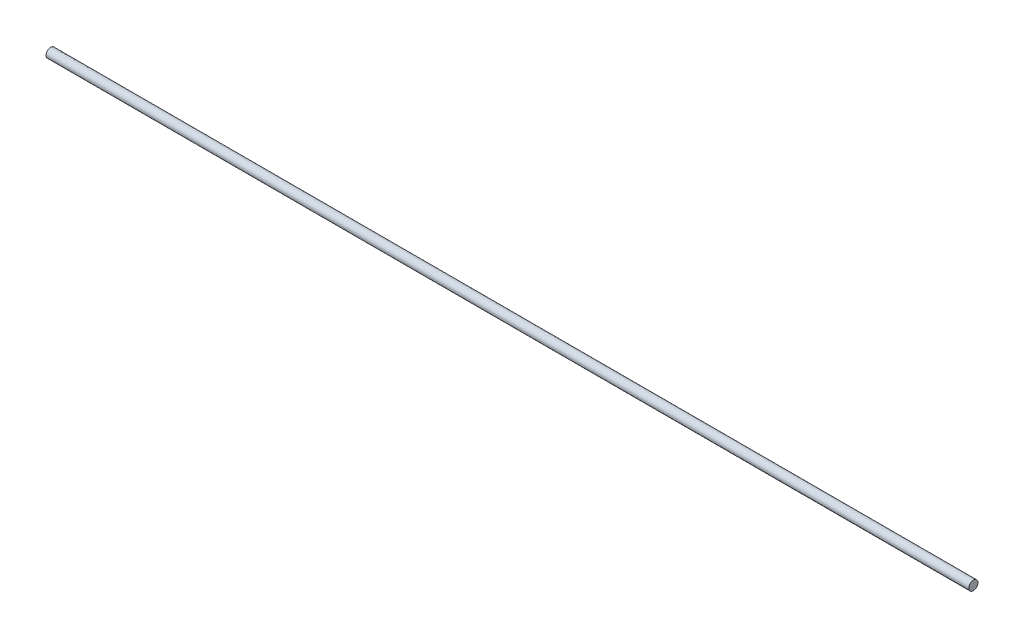
ISO-10303-21;
HEADER;
FILE_DESCRIPTION(('STEP AP214'),'2;1');
FILE_NAME('part.step','',(''),(''),'','','');
FILE_SCHEMA(('AUTOMOTIVE_DESIGN { 1 0 10303 214 1 1 1 1 }'));
ENDSEC;
DATA;
#1=APPLICATION_CONTEXT('core data for automotive mechanical design processes');
#2=APPLICATION_PROTOCOL_DEFINITION('international standard','automotive_design',2000,#1);
#3=PRODUCT_CONTEXT('',#1,'mechanical');
#4=PRODUCT('Part','Part','',(#3));
#5=PRODUCT_RELATED_PRODUCT_CATEGORY('part','',(#4));
#6=PRODUCT_DEFINITION_FORMATION('','',#4);
#7=PRODUCT_DEFINITION_CONTEXT('part definition',#1,'design');
#8=PRODUCT_DEFINITION('design','',#6,#7);
#9=PRODUCT_DEFINITION_SHAPE('','',#8);
#10=(LENGTH_UNIT() NAMED_UNIT(*) SI_UNIT(.MILLI.,.METRE.));
#11=(NAMED_UNIT(*) PLANE_ANGLE_UNIT() SI_UNIT($,.RADIAN.));
#12=(NAMED_UNIT(*) SI_UNIT($,.STERADIAN.) SOLID_ANGLE_UNIT());
#13=UNCERTAINTY_MEASURE_WITH_UNIT(LENGTH_MEASURE(1.E-05),#10,'distance_accuracy_value','');
#14=(GEOMETRIC_REPRESENTATION_CONTEXT(3) GLOBAL_UNCERTAINTY_ASSIGNED_CONTEXT((#13)) GLOBAL_UNIT_ASSIGNED_CONTEXT((#10,
#11,#12)) REPRESENTATION_CONTEXT('',''));
#15=CARTESIAN_POINT('',(0.,0.,0.));
#16=DIRECTION('',(0.,0.,1.));
#17=DIRECTION('',(1.,0.,0.));
#18=AXIS2_PLACEMENT_3D('',#15,#16,#17);
#19=CARTESIAN_POINT('',(100.,0.,0.));
#20=DIRECTION('',(-1.,0.,0.));
#21=DIRECTION('',(0.,0.,1.));
#22=AXIS2_PLACEMENT_3D('',#19,#20,#21);
#23=CYLINDRICAL_SURFACE('',#22,0.5);
#24=CARTESIAN_POINT('',(100.,0.,0.));
#25=DIRECTION('',(1.,0.,0.));
#26=DIRECTION('',(0.,0.,-1.));
#27=AXIS2_PLACEMENT_3D('',#24,#25,#26);
#28=CIRCLE('',#27,0.5);
#29=CARTESIAN_POINT('',(100.,0.,-0.5));
#30=VERTEX_POINT('',#29);
#31=EDGE_CURVE('E10',#30,#30,#28,.T.);
#32=ORIENTED_EDGE('',*,*,#31,.F.);
#33=EDGE_LOOP('',(#32));
#34=FACE_BOUND('',#33,.T.);
#35=CARTESIAN_POINT('',(0.,0.,0.));
#36=DIRECTION('',(1.,0.,0.));
#37=DIRECTION('',(0.,0.,-1.));
#38=AXIS2_PLACEMENT_3D('',#35,#36,#37);
#39=CIRCLE('',#38,0.5);
#40=CARTESIAN_POINT('',(0.,0.,-0.5));
#41=VERTEX_POINT('',#40);
#42=EDGE_CURVE('E37',#41,#41,#39,.T.);
#43=ORIENTED_EDGE('',*,*,#42,.T.);
#44=EDGE_LOOP('',(#43));
#45=FACE_BOUND('',#44,.T.);
#46=ADVANCED_FACE('F34',(#34,#45),#23,.T.);
#47=CARTESIAN_POINT('',(100.,0.,0.));
#48=DIRECTION('',(1.,0.,0.));
#49=DIRECTION('',(0.,0.,-1.));
#50=AXIS2_PLACEMENT_3D('',#47,#48,#49);
#51=PLANE('',#50);
#52=ORIENTED_EDGE('',*,*,#31,.T.);
#53=EDGE_LOOP('',(#52));
#54=FACE_BOUND('',#53,.T.);
#55=ADVANCED_FACE('F49',(#54),#51,.T.);
#56=CARTESIAN_POINT('',(0.,0.,0.));
#57=DIRECTION('',(1.,0.,0.));
#58=DIRECTION('',(0.,0.,-1.));
#59=AXIS2_PLACEMENT_3D('',#56,#57,#58);
#60=PLANE('',#59);
#61=ORIENTED_EDGE('',*,*,#42,.F.);
#62=EDGE_LOOP('',(#61));
#63=FACE_BOUND('',#62,.T.);
#64=ADVANCED_FACE('F47',(#63),#60,.F.);
#65=CLOSED_SHELL('',(#46,#55,#64));
#66=MANIFOLD_SOLID_BREP('B2',#65);
#67=ADVANCED_BREP_SHAPE_REPRESENTATION('',(#18,#66),#14);
#68=SHAPE_DEFINITION_REPRESENTATION(#9,#67);
ENDSEC;
END-ISO-10303-21;
